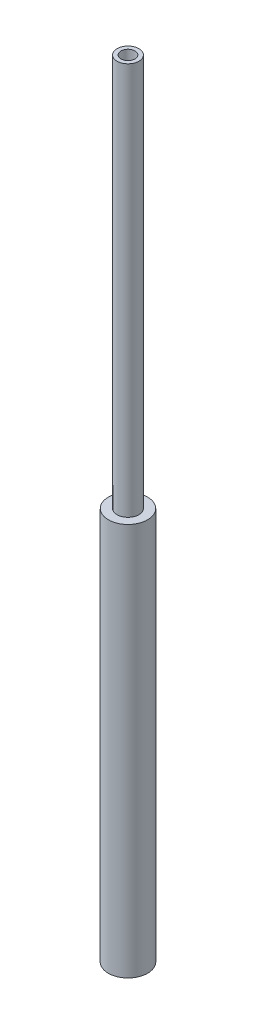
ISO-10303-21;
HEADER;
FILE_DESCRIPTION(('STEP AP214'),'2;1');
FILE_NAME('part.step','',(''),(''),'','','');
FILE_SCHEMA(('AUTOMOTIVE_DESIGN { 1 0 10303 214 1 1 1 1 }'));
ENDSEC;
DATA;
#1=APPLICATION_CONTEXT('core data for automotive mechanical design processes');
#2=APPLICATION_PROTOCOL_DEFINITION('international standard','automotive_design',2000,#1);
#3=PRODUCT_CONTEXT('',#1,'mechanical');
#4=PRODUCT('Part','Part','',(#3));
#5=PRODUCT_RELATED_PRODUCT_CATEGORY('part','',(#4));
#6=PRODUCT_DEFINITION_FORMATION('','',#4);
#7=PRODUCT_DEFINITION_CONTEXT('part definition',#1,'design');
#8=PRODUCT_DEFINITION('design','',#6,#7);
#9=PRODUCT_DEFINITION_SHAPE('','',#8);
#10=(LENGTH_UNIT() NAMED_UNIT(*) SI_UNIT(.MILLI.,.METRE.));
#11=(NAMED_UNIT(*) PLANE_ANGLE_UNIT() SI_UNIT($,.RADIAN.));
#12=(NAMED_UNIT(*) SI_UNIT($,.STERADIAN.) SOLID_ANGLE_UNIT());
#13=UNCERTAINTY_MEASURE_WITH_UNIT(LENGTH_MEASURE(1.E-05),#10,'distance_accuracy_value','');
#14=(GEOMETRIC_REPRESENTATION_CONTEXT(3) GLOBAL_UNCERTAINTY_ASSIGNED_CONTEXT((#13)) GLOBAL_UNIT_ASSIGNED_CONTEXT((#10,
#11,#12)) REPRESENTATION_CONTEXT('',''));
#15=CARTESIAN_POINT('',(0.,0.,0.));
#16=DIRECTION('',(0.,0.,1.));
#17=DIRECTION('',(1.,0.,0.));
#18=AXIS2_PLACEMENT_3D('',#15,#16,#17);
#19=CARTESIAN_POINT('',(0.,100.,0.));
#20=DIRECTION('',(0.,1.,0.));
#21=DIRECTION('',(0.,0.,1.));
#22=AXIS2_PLACEMENT_3D('',#19,#20,#21);
#23=PLANE('',#22);
#24=CARTESIAN_POINT('',(0.,100.,0.));
#25=DIRECTION('',(0.,1.,0.));
#26=DIRECTION('',(0.,0.,1.));
#27=AXIS2_PLACEMENT_3D('',#24,#25,#26);
#28=CIRCLE('',#27,1.389);
#29=CARTESIAN_POINT('',(0.,100.,1.389));
#30=VERTEX_POINT('',#29);
#31=EDGE_CURVE('E38',#30,#30,#28,.T.);
#32=ORIENTED_EDGE('',*,*,#31,.T.);
#33=EDGE_LOOP('',(#32));
#34=FACE_BOUND('',#33,.T.);
#35=CARTESIAN_POINT('',(0.,100.,0.));
#36=DIRECTION('',(0.,1.,0.));
#37=DIRECTION('',(0.,0.,1.));
#38=AXIS2_PLACEMENT_3D('',#35,#36,#37);
#39=CIRCLE('',#38,0.889);
#40=CARTESIAN_POINT('',(0.,100.,0.889));
#41=VERTEX_POINT('',#40);
#42=EDGE_CURVE('E42',#41,#41,#39,.T.);
#43=ORIENTED_EDGE('',*,*,#42,.F.);
#44=EDGE_LOOP('',(#43));
#45=FACE_BOUND('',#44,.T.);
#46=ADVANCED_FACE('F31',(#34,#45),#23,.T.);
#47=CARTESIAN_POINT('',(0.,100.,0.));
#48=DIRECTION('',(0.,-1.,0.));
#49=DIRECTION('',(0.,0.,-1.));
#50=AXIS2_PLACEMENT_3D('',#47,#48,#49);
#51=CYLINDRICAL_SURFACE('',#50,1.389);
#52=CARTESIAN_POINT('',(0.,50.,0.));
#53=DIRECTION('',(0.,1.,0.));
#54=DIRECTION('',(0.,0.,1.));
#55=AXIS2_PLACEMENT_3D('',#52,#53,#54);
#56=CIRCLE('',#55,1.389);
#57=CARTESIAN_POINT('',(0.,50.,1.389));
#58=VERTEX_POINT('',#57);
#59=EDGE_CURVE('E46',#58,#58,#56,.T.);
#60=ORIENTED_EDGE('',*,*,#59,.T.);
#61=EDGE_LOOP('',(#60));
#62=FACE_BOUND('',#61,.T.);
#63=ORIENTED_EDGE('',*,*,#31,.F.);
#64=EDGE_LOOP('',(#63));
#65=FACE_BOUND('',#64,.T.);
#66=ADVANCED_FACE('F33',(#62,#65),#51,.T.);
#67=CARTESIAN_POINT('',(0.,100.,0.));
#68=DIRECTION('',(0.,-1.,0.));
#69=DIRECTION('',(0.,0.,-1.));
#70=AXIS2_PLACEMENT_3D('',#67,#68,#69);
#71=CYLINDRICAL_SURFACE('',#70,0.889);
#72=CARTESIAN_POINT('',(0.,50.,0.));
#73=DIRECTION('',(0.,1.,0.));
#74=DIRECTION('',(0.,0.,1.));
#75=AXIS2_PLACEMENT_3D('',#72,#73,#74);
#76=CIRCLE('',#75,0.889);
#77=CARTESIAN_POINT('',(0.,50.,0.889));
#78=VERTEX_POINT('',#77);
#79=EDGE_CURVE('E10',#78,#78,#76,.T.);
#80=ORIENTED_EDGE('',*,*,#79,.F.);
#81=EDGE_LOOP('',(#80));
#82=FACE_BOUND('',#81,.T.);
#83=ORIENTED_EDGE('',*,*,#42,.T.);
#84=EDGE_LOOP('',(#83));
#85=FACE_BOUND('',#84,.T.);
#86=ADVANCED_FACE('F76',(#82,#85),#71,.F.);
#87=CARTESIAN_POINT('',(0.,50.,0.));
#88=DIRECTION('',(0.,1.,0.));
#89=DIRECTION('',(0.,0.,1.));
#90=AXIS2_PLACEMENT_3D('',#87,#88,#89);
#91=PLANE('',#90);
#92=ORIENTED_EDGE('',*,*,#79,.T.);
#93=EDGE_LOOP('',(#92));
#94=FACE_BOUND('',#93,.T.);
#95=ADVANCED_FACE('F81',(#94),#91,.T.);
#96=CARTESIAN_POINT('',(0.,50.,0.));
#97=DIRECTION('',(0.,1.,0.));
#98=DIRECTION('',(0.,0.,1.));
#99=AXIS2_PLACEMENT_3D('',#96,#97,#98);
#100=CIRCLE('',#99,2.5);
#101=CARTESIAN_POINT('',(0.,50.,2.5));
#102=VERTEX_POINT('',#101);
#103=EDGE_CURVE('E51',#102,#102,#100,.T.);
#104=ORIENTED_EDGE('',*,*,#103,.T.);
#105=EDGE_LOOP('',(#104));
#106=FACE_BOUND('',#105,.T.);
#107=ORIENTED_EDGE('',*,*,#59,.F.);
#108=EDGE_LOOP('',(#107));
#109=FACE_BOUND('',#108,.T.);
#110=ADVANCED_FACE('F58',(#106,#109),#91,.T.);
#111=CARTESIAN_POINT('',(0.,50.,0.));
#112=DIRECTION('',(0.,-1.,0.));
#113=DIRECTION('',(0.,0.,-1.));
#114=AXIS2_PLACEMENT_3D('',#111,#112,#113);
#115=CYLINDRICAL_SURFACE('',#114,2.5);
#116=ORIENTED_EDGE('',*,*,#103,.F.);
#117=EDGE_LOOP('',(#116));
#118=FACE_BOUND('',#117,.T.);
#119=CARTESIAN_POINT('',(0.,0.,0.));
#120=DIRECTION('',(0.,1.,0.));
#121=DIRECTION('',(0.,0.,1.));
#122=AXIS2_PLACEMENT_3D('',#119,#120,#121);
#123=CIRCLE('',#122,2.5);
#124=CARTESIAN_POINT('',(0.,0.,2.5));
#125=VERTEX_POINT('',#124);
#126=EDGE_CURVE('E52',#125,#125,#123,.T.);
#127=ORIENTED_EDGE('',*,*,#126,.T.);
#128=EDGE_LOOP('',(#127));
#129=FACE_BOUND('',#128,.T.);
#130=ADVANCED_FACE('F61',(#118,#129),#115,.T.);
#131=CARTESIAN_POINT('',(0.,0.,0.));
#132=DIRECTION('',(0.,1.,0.));
#133=DIRECTION('',(0.,0.,1.));
#134=AXIS2_PLACEMENT_3D('',#131,#132,#133);
#135=PLANE('',#134);
#136=ORIENTED_EDGE('',*,*,#126,.F.);
#137=EDGE_LOOP('',(#136));
#138=FACE_BOUND('',#137,.T.);
#139=ADVANCED_FACE('F64',(#138),#135,.F.);
#140=CLOSED_SHELL('',(#46,#66,#86,#95,#110,#130,#139));
#141=MANIFOLD_SOLID_BREP('B2',#140);
#142=ADVANCED_BREP_SHAPE_REPRESENTATION('',(#18,#141),#14);
#143=SHAPE_DEFINITION_REPRESENTATION(#9,#142);
ENDSEC;
END-ISO-10303-21;
